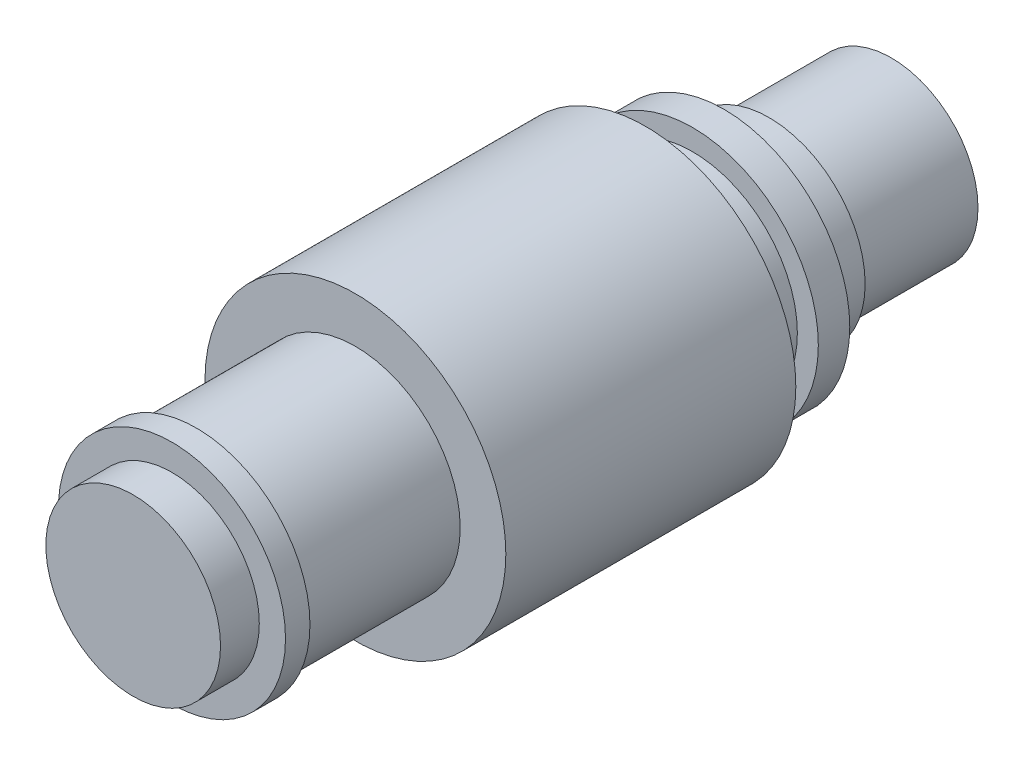
ISO-10303-21;
HEADER;
FILE_DESCRIPTION(('STEP AP214'),'2;1');
FILE_NAME('part.step','',(''),(''),'','','');
FILE_SCHEMA(('AUTOMOTIVE_DESIGN { 1 0 10303 214 1 1 1 1 }'));
ENDSEC;
DATA;
#1=APPLICATION_CONTEXT('core data for automotive mechanical design processes');
#2=APPLICATION_PROTOCOL_DEFINITION('international standard','automotive_design',2000,#1);
#3=PRODUCT_CONTEXT('',#1,'mechanical');
#4=PRODUCT('Part','Part','',(#3));
#5=PRODUCT_RELATED_PRODUCT_CATEGORY('part','',(#4));
#6=PRODUCT_DEFINITION_FORMATION('','',#4);
#7=PRODUCT_DEFINITION_CONTEXT('part definition',#1,'design');
#8=PRODUCT_DEFINITION('design','',#6,#7);
#9=PRODUCT_DEFINITION_SHAPE('','',#8);
#10=(LENGTH_UNIT() NAMED_UNIT(*) SI_UNIT(.MILLI.,.METRE.));
#11=(NAMED_UNIT(*) PLANE_ANGLE_UNIT() SI_UNIT($,.RADIAN.));
#12=(NAMED_UNIT(*) SI_UNIT($,.STERADIAN.) SOLID_ANGLE_UNIT());
#13=UNCERTAINTY_MEASURE_WITH_UNIT(LENGTH_MEASURE(1.E-05),#10,'distance_accuracy_value','');
#14=(GEOMETRIC_REPRESENTATION_CONTEXT(3) GLOBAL_UNCERTAINTY_ASSIGNED_CONTEXT((#13)) GLOBAL_UNIT_ASSIGNED_CONTEXT((#10,
#11,#12)) REPRESENTATION_CONTEXT('',''));
#15=CARTESIAN_POINT('',(0.,0.,0.));
#16=DIRECTION('',(0.,0.,1.));
#17=DIRECTION('',(1.,0.,0.));
#18=AXIS2_PLACEMENT_3D('',#15,#16,#17);
#19=CARTESIAN_POINT('',(0.,0.,0.));
#20=DIRECTION('',(0.,0.,1.));
#21=DIRECTION('',(1.,0.,0.));
#22=AXIS2_PLACEMENT_3D('',#19,#20,#21);
#23=CYLINDRICAL_SURFACE('',#22,30.);
#24=CARTESIAN_POINT('',(0.,0.,-160.1));
#25=DIRECTION('',(0.,0.,1.));
#26=DIRECTION('',(1.,0.,0.));
#27=AXIS2_PLACEMENT_3D('',#24,#25,#26);
#28=CIRCLE('',#27,30.);
#29=CARTESIAN_POINT('',(30.,0.,-160.1));
#30=VERTEX_POINT('',#29);
#31=EDGE_CURVE('E66',#30,#30,#28,.T.);
#32=ORIENTED_EDGE('',*,*,#31,.T.);
#33=EDGE_LOOP('',(#32));
#34=FACE_BOUND('',#33,.T.);
#35=CARTESIAN_POINT('',(0.,0.,-146.6));
#36=DIRECTION('',(0.,0.,1.));
#37=DIRECTION('',(1.,0.,0.));
#38=AXIS2_PLACEMENT_3D('',#35,#36,#37);
#39=CIRCLE('',#38,30.);
#40=CARTESIAN_POINT('',(30.,0.,-146.6));
#41=VERTEX_POINT('',#40);
#42=EDGE_CURVE('E10',#41,#41,#39,.T.);
#43=ORIENTED_EDGE('',*,*,#42,.F.);
#44=EDGE_LOOP('',(#43));
#45=FACE_BOUND('',#44,.T.);
#46=ADVANCED_FACE('F37',(#34,#45),#23,.T.);
#47=CARTESIAN_POINT('',(0.,24.8,-217.));
#48=DIRECTION('',(0.,0.,1.));
#49=DIRECTION('',(1.,0.,0.));
#50=AXIS2_PLACEMENT_3D('',#47,#48,#49);
#51=PLANE('',#50);
#52=CARTESIAN_POINT('',(0.,0.,-217.));
#53=DIRECTION('',(0.,0.,1.));
#54=DIRECTION('',(1.,0.,0.));
#55=AXIS2_PLACEMENT_3D('',#52,#53,#54);
#56=CIRCLE('',#55,24.8);
#57=CARTESIAN_POINT('',(24.8,0.,-217.));
#58=VERTEX_POINT('',#57);
#59=EDGE_CURVE('E45',#58,#58,#56,.T.);
#60=ORIENTED_EDGE('',*,*,#59,.F.);
#61=EDGE_LOOP('',(#60));
#62=FACE_BOUND('',#61,.T.);
#63=ADVANCED_FACE('F111',(#62),#51,.F.);
#64=CARTESIAN_POINT('',(0.,0.,0.));
#65=DIRECTION('',(0.,0.,1.));
#66=DIRECTION('',(1.,0.,0.));
#67=AXIS2_PLACEMENT_3D('',#64,#65,#66);
#68=CYLINDRICAL_SURFACE('',#67,24.8);
#69=CARTESIAN_POINT('',(0.,0.,-182.));
#70=DIRECTION('',(0.,0.,1.));
#71=DIRECTION('',(1.,0.,0.));
#72=AXIS2_PLACEMENT_3D('',#69,#70,#71);
#73=CIRCLE('',#72,24.8);
#74=CARTESIAN_POINT('',(24.8,0.,-182.));
#75=VERTEX_POINT('',#74);
#76=EDGE_CURVE('E49',#75,#75,#73,.T.);
#77=ORIENTED_EDGE('',*,*,#76,.F.);
#78=EDGE_LOOP('',(#77));
#79=FACE_BOUND('',#78,.T.);
#80=ORIENTED_EDGE('',*,*,#59,.T.);
#81=EDGE_LOOP('',(#80));
#82=FACE_BOUND('',#81,.T.);
#83=ADVANCED_FACE('F117',(#79,#82),#68,.T.);
#84=CARTESIAN_POINT('',(0.,27.500000118,-182.));
#85=DIRECTION('',(0.,0.,1.));
#86=DIRECTION('',(1.,0.,0.));
#87=AXIS2_PLACEMENT_3D('',#84,#85,#86);
#88=PLANE('',#87);
#89=CARTESIAN_POINT('',(0.,0.,-182.));
#90=DIRECTION('',(0.,0.,1.));
#91=DIRECTION('',(1.,0.,0.));
#92=AXIS2_PLACEMENT_3D('',#89,#90,#91);
#93=CIRCLE('',#92,27.500000118);
#94=CARTESIAN_POINT('',(27.500000118,0.,-182.));
#95=VERTEX_POINT('',#94);
#96=EDGE_CURVE('E54',#95,#95,#93,.T.);
#97=ORIENTED_EDGE('',*,*,#96,.F.);
#98=EDGE_LOOP('',(#97));
#99=FACE_BOUND('',#98,.T.);
#100=ORIENTED_EDGE('',*,*,#76,.T.);
#101=EDGE_LOOP('',(#100));
#102=FACE_BOUND('',#101,.T.);
#103=ADVANCED_FACE('F230',(#99,#102),#88,.F.);
#104=CARTESIAN_POINT('',(0.,0.,0.));
#105=DIRECTION('',(0.,0.,1.));
#106=DIRECTION('',(1.,0.,0.));
#107=AXIS2_PLACEMENT_3D('',#104,#105,#106);
#108=CYLINDRICAL_SURFACE('',#107,27.500000118);
#109=CARTESIAN_POINT('',(0.,0.,-169.1));
#110=DIRECTION('',(0.,0.,1.));
#111=DIRECTION('',(1.,0.,0.));
#112=AXIS2_PLACEMENT_3D('',#109,#110,#111);
#113=CIRCLE('',#112,27.500000118);
#114=CARTESIAN_POINT('',(27.500000118,0.,-169.1));
#115=VERTEX_POINT('',#114);
#116=EDGE_CURVE('E57',#115,#115,#113,.T.);
#117=ORIENTED_EDGE('',*,*,#116,.F.);
#118=EDGE_LOOP('',(#117));
#119=FACE_BOUND('',#118,.T.);
#120=ORIENTED_EDGE('',*,*,#96,.T.);
#121=EDGE_LOOP('',(#120));
#122=FACE_BOUND('',#121,.T.);
#123=ADVANCED_FACE('F222',(#119,#122),#108,.T.);
#124=CARTESIAN_POINT('',(0.,27.500000118,-169.1));
#125=DIRECTION('',(0.,0.,1.));
#126=DIRECTION('',(1.,0.,0.));
#127=AXIS2_PLACEMENT_3D('',#124,#125,#126);
#128=PLANE('',#127);
#129=CARTESIAN_POINT('',(0.,0.,-169.1));
#130=DIRECTION('',(0.,0.,1.));
#131=DIRECTION('',(1.,0.,0.));
#132=AXIS2_PLACEMENT_3D('',#129,#130,#131);
#133=CIRCLE('',#132,36.);
#134=CARTESIAN_POINT('',(36.,0.,-169.1));
#135=VERTEX_POINT('',#134);
#136=EDGE_CURVE('E60',#135,#135,#133,.T.);
#137=ORIENTED_EDGE('',*,*,#136,.F.);
#138=EDGE_LOOP('',(#137));
#139=FACE_BOUND('',#138,.T.);
#140=ORIENTED_EDGE('',*,*,#116,.T.);
#141=EDGE_LOOP('',(#140));
#142=FACE_BOUND('',#141,.T.);
#143=ADVANCED_FACE('F215',(#139,#142),#128,.F.);
#144=CARTESIAN_POINT('',(0.,0.,0.));
#145=DIRECTION('',(0.,0.,1.));
#146=DIRECTION('',(1.,0.,0.));
#147=AXIS2_PLACEMENT_3D('',#144,#145,#146);
#148=CYLINDRICAL_SURFACE('',#147,36.);
#149=CARTESIAN_POINT('',(0.,0.,-160.1));
#150=DIRECTION('',(0.,0.,1.));
#151=DIRECTION('',(1.,0.,0.));
#152=AXIS2_PLACEMENT_3D('',#149,#150,#151);
#153=CIRCLE('',#152,36.);
#154=CARTESIAN_POINT('',(36.,0.,-160.1));
#155=VERTEX_POINT('',#154);
#156=EDGE_CURVE('E63',#155,#155,#153,.T.);
#157=ORIENTED_EDGE('',*,*,#156,.F.);
#158=EDGE_LOOP('',(#157));
#159=FACE_BOUND('',#158,.T.);
#160=ORIENTED_EDGE('',*,*,#136,.T.);
#161=EDGE_LOOP('',(#160));
#162=FACE_BOUND('',#161,.T.);
#163=ADVANCED_FACE('F209',(#159,#162),#148,.T.);
#164=CARTESIAN_POINT('',(0.,36.,-160.1));
#165=DIRECTION('',(0.,0.,-1.));
#166=DIRECTION('',(-1.,0.,0.));
#167=AXIS2_PLACEMENT_3D('',#164,#165,#166);
#168=PLANE('',#167);
#169=ORIENTED_EDGE('',*,*,#31,.F.);
#170=EDGE_LOOP('',(#169));
#171=FACE_BOUND('',#170,.T.);
#172=ORIENTED_EDGE('',*,*,#156,.T.);
#173=EDGE_LOOP('',(#172));
#174=FACE_BOUND('',#173,.T.);
#175=ADVANCED_FACE('F107',(#171,#174),#168,.F.);
#176=CARTESIAN_POINT('',(0.,0.,-63.6));
#177=DIRECTION('',(0.,0.,-1.));
#178=DIRECTION('',(-1.,0.,0.));
#179=AXIS2_PLACEMENT_3D('',#176,#177,#178);
#180=CYLINDRICAL_SURFACE('',#179,43.0575412116758);
#181=CARTESIAN_POINT('',(0.,0.,-63.6));
#182=DIRECTION('',(0.,0.,1.));
#183=DIRECTION('',(1.,0.,0.));
#184=AXIS2_PLACEMENT_3D('',#181,#182,#183);
#185=CIRCLE('',#184,43.0575412116758);
#186=CARTESIAN_POINT('',(43.0575412116758,0.,-63.6));
#187=VERTEX_POINT('',#186);
#188=EDGE_CURVE('E87',#187,#187,#185,.T.);
#189=ORIENTED_EDGE('',*,*,#188,.F.);
#190=EDGE_LOOP('',(#189));
#191=FACE_BOUND('',#190,.T.);
#192=CARTESIAN_POINT('',(0.,0.,-146.6));
#193=DIRECTION('',(0.,0.,1.));
#194=DIRECTION('',(1.,0.,0.));
#195=AXIS2_PLACEMENT_3D('',#192,#193,#194);
#196=CIRCLE('',#195,43.0575412116758);
#197=CARTESIAN_POINT('',(43.0575412116758,0.,-146.6));
#198=VERTEX_POINT('',#197);
#199=EDGE_CURVE('E84',#198,#198,#196,.T.);
#200=ORIENTED_EDGE('',*,*,#199,.T.);
#201=EDGE_LOOP('',(#200));
#202=FACE_BOUND('',#201,.T.);
#203=ADVANCED_FACE('F100',(#191,#202),#180,.T.);
#204=CARTESIAN_POINT('',(0.,0.,-63.6));
#205=DIRECTION('',(0.,0.,1.));
#206=DIRECTION('',(1.,0.,0.));
#207=AXIS2_PLACEMENT_3D('',#204,#205,#206);
#208=PLANE('',#207);
#209=CARTESIAN_POINT('',(0.,0.,-63.6));
#210=DIRECTION('',(0.,0.,1.));
#211=DIRECTION('',(1.,0.,0.));
#212=AXIS2_PLACEMENT_3D('',#209,#210,#211);
#213=CIRCLE('',#212,30.);
#214=CARTESIAN_POINT('',(30.,0.,-63.6));
#215=VERTEX_POINT('',#214);
#216=EDGE_CURVE('E41',#215,#215,#213,.T.);
#217=ORIENTED_EDGE('',*,*,#216,.F.);
#218=EDGE_LOOP('',(#217));
#219=FACE_BOUND('',#218,.T.);
#220=ORIENTED_EDGE('',*,*,#188,.T.);
#221=EDGE_LOOP('',(#220));
#222=FACE_BOUND('',#221,.T.);
#223=ADVANCED_FACE('F97',(#219,#222),#208,.T.);
#224=CARTESIAN_POINT('',(0.,0.,-146.6));
#225=DIRECTION('',(0.,0.,1.));
#226=DIRECTION('',(1.,0.,0.));
#227=AXIS2_PLACEMENT_3D('',#224,#225,#226);
#228=PLANE('',#227);
#229=ORIENTED_EDGE('',*,*,#42,.T.);
#230=EDGE_LOOP('',(#229));
#231=FACE_BOUND('',#230,.T.);
#232=ORIENTED_EDGE('',*,*,#199,.F.);
#233=EDGE_LOOP('',(#232));
#234=FACE_BOUND('',#233,.T.);
#235=ADVANCED_FACE('F99',(#231,#234),#228,.F.);
#236=CARTESIAN_POINT('',(0.,25.,0.));
#237=DIRECTION('',(0.,0.,-1.));
#238=DIRECTION('',(-1.,0.,0.));
#239=AXIS2_PLACEMENT_3D('',#236,#237,#238);
#240=PLANE('',#239);
#241=CARTESIAN_POINT('',(0.,0.,0.));
#242=DIRECTION('',(0.,0.,1.));
#243=DIRECTION('',(1.,0.,0.));
#244=AXIS2_PLACEMENT_3D('',#241,#242,#243);
#245=CIRCLE('',#244,25.);
#246=CARTESIAN_POINT('',(25.,0.,0.));
#247=VERTEX_POINT('',#246);
#248=EDGE_CURVE('E81',#247,#247,#245,.T.);
#249=ORIENTED_EDGE('',*,*,#248,.T.);
#250=EDGE_LOOP('',(#249));
#251=FACE_BOUND('',#250,.T.);
#252=ADVANCED_FACE('F39',(#251),#240,.F.);
#253=CARTESIAN_POINT('',(0.,0.,0.));
#254=DIRECTION('',(0.,0.,1.));
#255=DIRECTION('',(1.,0.,0.));
#256=AXIS2_PLACEMENT_3D('',#253,#254,#255);
#257=CYLINDRICAL_SURFACE('',#256,25.);
#258=ORIENTED_EDGE('',*,*,#248,.F.);
#259=EDGE_LOOP('',(#258));
#260=FACE_BOUND('',#259,.T.);
#261=CARTESIAN_POINT('',(0.,0.,-11.1));
#262=DIRECTION('',(0.,0.,1.));
#263=DIRECTION('',(1.,0.,0.));
#264=AXIS2_PLACEMENT_3D('',#261,#262,#263);
#265=CIRCLE('',#264,25.);
#266=CARTESIAN_POINT('',(25.,0.,-11.1));
#267=VERTEX_POINT('',#266);
#268=EDGE_CURVE('E78',#267,#267,#265,.T.);
#269=ORIENTED_EDGE('',*,*,#268,.T.);
#270=EDGE_LOOP('',(#269));
#271=FACE_BOUND('',#270,.T.);
#272=ADVANCED_FACE('F140',(#260,#271),#257,.T.);
#273=CARTESIAN_POINT('',(0.,32.5,-11.1));
#274=DIRECTION('',(0.,0.,-1.));
#275=DIRECTION('',(-1.,0.,0.));
#276=AXIS2_PLACEMENT_3D('',#273,#274,#275);
#277=PLANE('',#276);
#278=ORIENTED_EDGE('',*,*,#268,.F.);
#279=EDGE_LOOP('',(#278));
#280=FACE_BOUND('',#279,.T.);
#281=CARTESIAN_POINT('',(0.,0.,-11.1));
#282=DIRECTION('',(0.,0.,1.));
#283=DIRECTION('',(1.,0.,0.));
#284=AXIS2_PLACEMENT_3D('',#281,#282,#283);
#285=CIRCLE('',#284,32.5);
#286=CARTESIAN_POINT('',(32.5,0.,-11.1));
#287=VERTEX_POINT('',#286);
#288=EDGE_CURVE('E75',#287,#287,#285,.T.);
#289=ORIENTED_EDGE('',*,*,#288,.T.);
#290=EDGE_LOOP('',(#289));
#291=FACE_BOUND('',#290,.T.);
#292=ADVANCED_FACE('F132',(#280,#291),#277,.F.);
#293=CARTESIAN_POINT('',(0.,0.,0.));
#294=DIRECTION('',(0.,0.,1.));
#295=DIRECTION('',(1.,0.,0.));
#296=AXIS2_PLACEMENT_3D('',#293,#294,#295);
#297=CYLINDRICAL_SURFACE('',#296,32.5);
#298=ORIENTED_EDGE('',*,*,#288,.F.);
#299=EDGE_LOOP('',(#298));
#300=FACE_BOUND('',#299,.T.);
#301=CARTESIAN_POINT('',(0.,0.,-18.1));
#302=DIRECTION('',(0.,0.,1.));
#303=DIRECTION('',(1.,0.,0.));
#304=AXIS2_PLACEMENT_3D('',#301,#302,#303);
#305=CIRCLE('',#304,32.5);
#306=CARTESIAN_POINT('',(32.5,0.,-18.1));
#307=VERTEX_POINT('',#306);
#308=EDGE_CURVE('E72',#307,#307,#305,.T.);
#309=ORIENTED_EDGE('',*,*,#308,.T.);
#310=EDGE_LOOP('',(#309));
#311=FACE_BOUND('',#310,.T.);
#312=ADVANCED_FACE('F127',(#300,#311),#297,.T.);
#313=CARTESIAN_POINT('',(0.,30.,-18.1));
#314=DIRECTION('',(0.,0.,1.));
#315=DIRECTION('',(1.,0.,0.));
#316=AXIS2_PLACEMENT_3D('',#313,#314,#315);
#317=PLANE('',#316);
#318=ORIENTED_EDGE('',*,*,#308,.F.);
#319=EDGE_LOOP('',(#318));
#320=FACE_BOUND('',#319,.T.);
#321=CARTESIAN_POINT('',(0.,0.,-18.1));
#322=DIRECTION('',(0.,0.,1.));
#323=DIRECTION('',(1.,0.,0.));
#324=AXIS2_PLACEMENT_3D('',#321,#322,#323);
#325=CIRCLE('',#324,30.);
#326=CARTESIAN_POINT('',(30.,0.,-18.1));
#327=VERTEX_POINT('',#326);
#328=EDGE_CURVE('E69',#327,#327,#325,.T.);
#329=ORIENTED_EDGE('',*,*,#328,.T.);
#330=EDGE_LOOP('',(#329));
#331=FACE_BOUND('',#330,.T.);
#332=ADVANCED_FACE('F123',(#320,#331),#317,.F.);
#333=ORIENTED_EDGE('',*,*,#216,.T.);
#334=EDGE_LOOP('',(#333));
#335=FACE_BOUND('',#334,.T.);
#336=ORIENTED_EDGE('',*,*,#328,.F.);
#337=EDGE_LOOP('',(#336));
#338=FACE_BOUND('',#337,.T.);
#339=ADVANCED_FACE('F94',(#335,#338),#23,.T.);
#340=CLOSED_SHELL('',(#46,#63,#83,#103,#123,#143,#163,#175,#203,#223,#235,#252,#272,#292,#312,
#332,#339));
#341=MANIFOLD_SOLID_BREP('B2',#340);
#342=ADVANCED_BREP_SHAPE_REPRESENTATION('',(#18,#341),#14);
#343=SHAPE_DEFINITION_REPRESENTATION(#9,#342);
ENDSEC;
END-ISO-10303-21;
